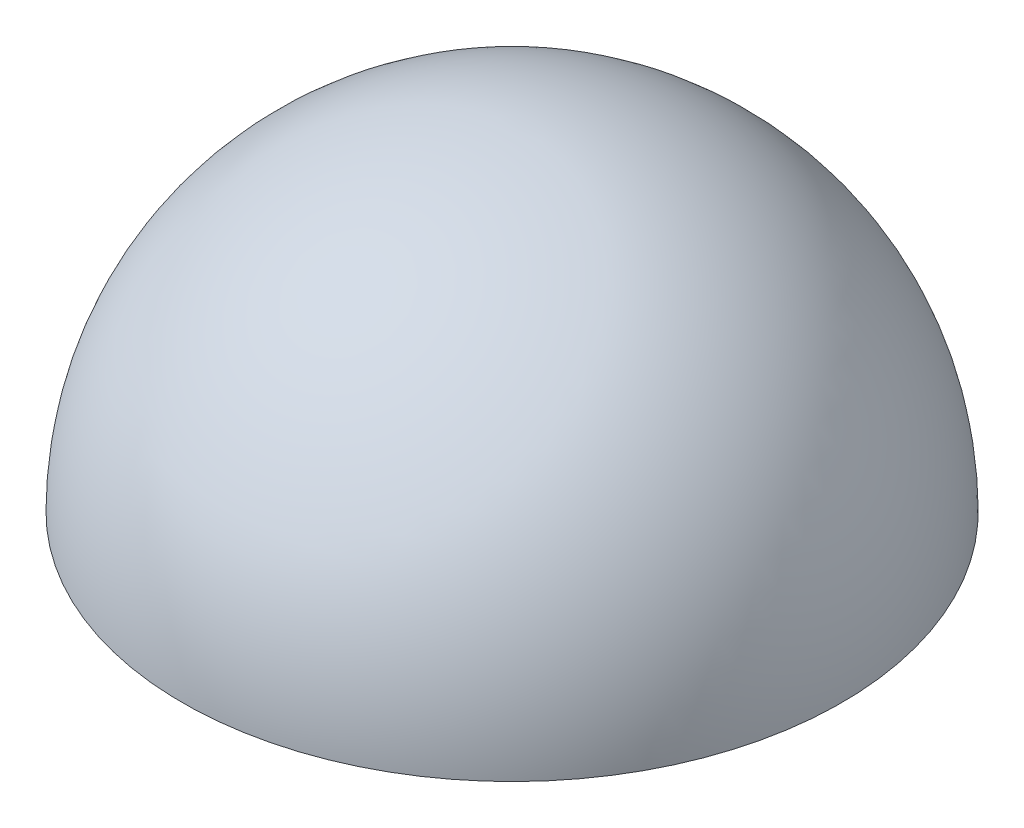
ISO-10303-21;
HEADER;
FILE_DESCRIPTION(('STEP AP214'),'2;1');
FILE_NAME('part.step','',(''),(''),'','','');
FILE_SCHEMA(('AUTOMOTIVE_DESIGN { 1 0 10303 214 1 1 1 1 }'));
ENDSEC;
DATA;
#1=APPLICATION_CONTEXT('core data for automotive mechanical design processes');
#2=APPLICATION_PROTOCOL_DEFINITION('international standard','automotive_design',2000,#1);
#3=PRODUCT_CONTEXT('',#1,'mechanical');
#4=PRODUCT('Part','Part','',(#3));
#5=PRODUCT_RELATED_PRODUCT_CATEGORY('part','',(#4));
#6=PRODUCT_DEFINITION_FORMATION('','',#4);
#7=PRODUCT_DEFINITION_CONTEXT('part definition',#1,'design');
#8=PRODUCT_DEFINITION('design','',#6,#7);
#9=PRODUCT_DEFINITION_SHAPE('','',#8);
#10=(LENGTH_UNIT() NAMED_UNIT(*) SI_UNIT(.MILLI.,.METRE.));
#11=(NAMED_UNIT(*) PLANE_ANGLE_UNIT() SI_UNIT($,.RADIAN.));
#12=(NAMED_UNIT(*) SI_UNIT($,.STERADIAN.) SOLID_ANGLE_UNIT());
#13=UNCERTAINTY_MEASURE_WITH_UNIT(LENGTH_MEASURE(1.E-05),#10,'distance_accuracy_value','');
#14=(GEOMETRIC_REPRESENTATION_CONTEXT(3) GLOBAL_UNCERTAINTY_ASSIGNED_CONTEXT((#13)) GLOBAL_UNIT_ASSIGNED_CONTEXT((#10,
#11,#12)) REPRESENTATION_CONTEXT('',''));
#15=CARTESIAN_POINT('',(0.,0.,0.));
#16=DIRECTION('',(0.,0.,1.));
#17=DIRECTION('',(1.,0.,0.));
#18=AXIS2_PLACEMENT_3D('',#15,#16,#17);
#19=CARTESIAN_POINT('',(0.,0.,0.));
#20=DIRECTION('',(0.,0.,-1.));
#21=DIRECTION('',(1.,0.,0.));
#22=AXIS2_PLACEMENT_3D('',#19,#20,#21);
#23=SPHERICAL_SURFACE('',#22,4597.4);
#24=CARTESIAN_POINT('',(0.,0.,0.));
#25=DIRECTION('',(0.,1.,0.));
#26=DIRECTION('',(0.,0.,-1.));
#27=AXIS2_PLACEMENT_3D('',#24,#25,#26);
#28=SPHERICAL_SURFACE('',#27,4597.4);
#29=CARTESIAN_POINT('',(0.,0.,0.));
#30=DIRECTION('',(0.,1.,0.));
#31=DIRECTION('',(0.,0.,-1.));
#32=AXIS2_PLACEMENT_3D('',#29,#30,#31);
#33=CIRCLE('',#32,4597.4);
#34=CARTESIAN_POINT('',(0.,0.,-4597.4));
#35=VERTEX_POINT('',#34);
#36=EDGE_CURVE('E37',#35,#35,#33,.T.);
#37=ORIENTED_EDGE('',*,*,#36,.F.);
#38=EDGE_LOOP('',(#37));
#39=FACE_BOUND('',#38,.T.);
#40=ADVANCED_FACE('F30',(#39),#28,.F.);
#41=CARTESIAN_POINT('',(-8.90035119169039E-13,0.,0.));
#42=DIRECTION('',(0.,0.,-1.));
#43=DIRECTION('',(-1.,0.,0.));
#44=AXIS2_PLACEMENT_3D('',#41,#42,#43);
#45=SPHERICAL_SURFACE('',#44,4622.8);
#46=CARTESIAN_POINT('',(-8.90035119169039E-13,0.,0.));
#47=DIRECTION('',(0.,-1.,0.));
#48=DIRECTION('',(0.,0.,-1.));
#49=AXIS2_PLACEMENT_3D('',#46,#47,#48);
#50=SPHERICAL_SURFACE('',#49,4622.8);
#51=CARTESIAN_POINT('',(-8.90035119169039E-13,0.,0.));
#52=DIRECTION('',(0.,-1.,0.));
#53=DIRECTION('',(0.,0.,-1.));
#54=AXIS2_PLACEMENT_3D('',#51,#52,#53);
#55=CIRCLE('',#54,4622.8);
#56=CARTESIAN_POINT('',(-8.90035119169039E-13,0.,-4622.8));
#57=VERTEX_POINT('',#56);
#58=EDGE_CURVE('E10',#57,#57,#55,.T.);
#59=ORIENTED_EDGE('',*,*,#58,.F.);
#60=EDGE_LOOP('',(#59));
#61=FACE_BOUND('',#60,.T.);
#62=ADVANCED_FACE('F32',(#61),#50,.T.);
#63=CARTESIAN_POINT('',(0.,0.,0.));
#64=DIRECTION('',(0.,1.,0.));
#65=DIRECTION('',(0.,0.,-1.));
#66=AXIS2_PLACEMENT_3D('',#63,#64,#65);
#67=PLANE('',#66);
#68=ORIENTED_EDGE('',*,*,#58,.T.);
#69=EDGE_LOOP('',(#68));
#70=FACE_BOUND('',#69,.T.);
#71=ORIENTED_EDGE('',*,*,#36,.T.);
#72=EDGE_LOOP('',(#71));
#73=FACE_BOUND('',#72,.T.);
#74=ADVANCED_FACE('F43',(#70,#73),#67,.F.);
#75=CLOSED_SHELL('',(#40,#62,#74));
#76=MANIFOLD_SOLID_BREP('B2',#75);
#77=ADVANCED_BREP_SHAPE_REPRESENTATION('',(#18,#76),#14);
#78=SHAPE_DEFINITION_REPRESENTATION(#9,#77);
ENDSEC;
END-ISO-10303-21;
